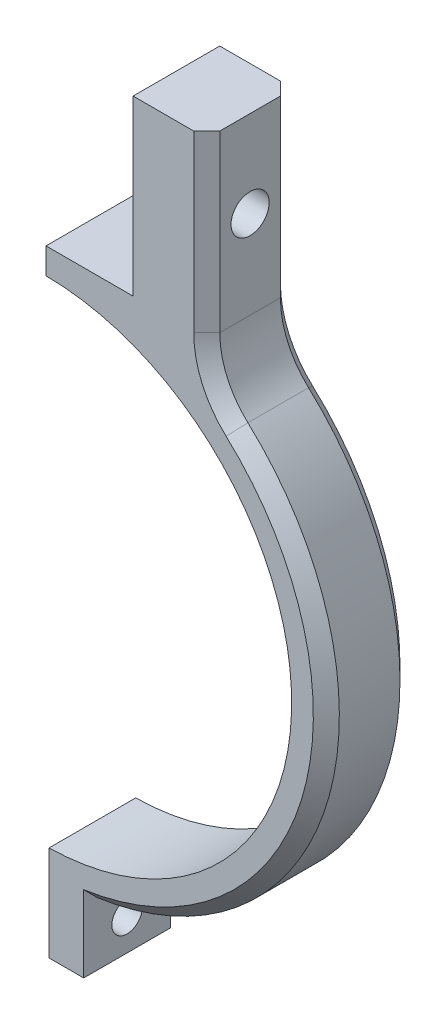
ISO-10303-21;
HEADER;
FILE_DESCRIPTION(('STEP AP214'),'2;1');
FILE_NAME('part.step','',(''),(''),'','','');
FILE_SCHEMA(('AUTOMOTIVE_DESIGN { 1 0 10303 214 1 1 1 1 }'));
ENDSEC;
DATA;
#1=APPLICATION_CONTEXT('core data for automotive mechanical design processes');
#2=APPLICATION_PROTOCOL_DEFINITION('international standard','automotive_design',2000,#1);
#3=PRODUCT_CONTEXT('',#1,'mechanical');
#4=PRODUCT('Part','Part','',(#3));
#5=PRODUCT_RELATED_PRODUCT_CATEGORY('part','',(#4));
#6=PRODUCT_DEFINITION_FORMATION('','',#4);
#7=PRODUCT_DEFINITION_CONTEXT('part definition',#1,'design');
#8=PRODUCT_DEFINITION('design','',#6,#7);
#9=PRODUCT_DEFINITION_SHAPE('','',#8);
#10=(LENGTH_UNIT() NAMED_UNIT(*) SI_UNIT(.MILLI.,.METRE.));
#11=(NAMED_UNIT(*) PLANE_ANGLE_UNIT() SI_UNIT($,.RADIAN.));
#12=(NAMED_UNIT(*) SI_UNIT($,.STERADIAN.) SOLID_ANGLE_UNIT());
#13=UNCERTAINTY_MEASURE_WITH_UNIT(LENGTH_MEASURE(1.E-05),#10,'distance_accuracy_value','');
#14=(GEOMETRIC_REPRESENTATION_CONTEXT(3) GLOBAL_UNCERTAINTY_ASSIGNED_CONTEXT((#13)) GLOBAL_UNIT_ASSIGNED_CONTEXT((#10,
#11,#12)) REPRESENTATION_CONTEXT('',''));
#15=CARTESIAN_POINT('',(0.,0.,0.));
#16=DIRECTION('',(0.,0.,1.));
#17=DIRECTION('',(1.,0.,0.));
#18=AXIS2_PLACEMENT_3D('',#15,#16,#17);
#19=CARTESIAN_POINT('',(-10.2,31.5,10.));
#20=DIRECTION('',(0.,-1.,0.));
#21=DIRECTION('',(0.,0.,-1.));
#22=AXIS2_PLACEMENT_3D('',#19,#20,#21);
#23=PLANE('',#22);
#24=DIRECTION('',(0.,0.,-1.));
#25=VECTOR('',#24,1.);
#26=CARTESIAN_POINT('',(0.150000000000001,31.5,10.));
#27=LINE('',#26,#25);
#28=CARTESIAN_POINT('',(0.15,31.5,10.));
#29=VERTEX_POINT('',#28);
#30=CARTESIAN_POINT('',(0.150000000000001,31.5,0.));
#31=VERTEX_POINT('',#30);
#32=EDGE_CURVE('E55',#29,#31,#27,.T.);
#33=ORIENTED_EDGE('',*,*,#32,.F.);
#34=DIRECTION('',(-1.,0.,0.));
#35=VECTOR('',#34,1.);
#36=CARTESIAN_POINT('',(-10.2,31.5,10.));
#37=LINE('',#36,#35);
#38=CARTESIAN_POINT('',(10.2,31.5,10.));
#39=VERTEX_POINT('',#38);
#40=EDGE_CURVE('E160',#39,#29,#37,.T.);
#41=ORIENTED_EDGE('',*,*,#40,.F.);
#42=DIRECTION('',(0.,0.,-1.));
#43=VECTOR('',#42,1.);
#44=CARTESIAN_POINT('',(10.2,31.5,10.));
#45=LINE('',#44,#43);
#46=CARTESIAN_POINT('',(10.2,31.5,0.));
#47=VERTEX_POINT('',#46);
#48=EDGE_CURVE('E201',#39,#47,#45,.T.);
#49=ORIENTED_EDGE('',*,*,#48,.T.);
#50=DIRECTION('',(-1.,0.,0.));
#51=VECTOR('',#50,1.);
#52=CARTESIAN_POINT('',(-10.2,31.5,0.));
#53=LINE('',#52,#51);
#54=EDGE_CURVE('E184',#47,#31,#53,.T.);
#55=ORIENTED_EDGE('',*,*,#54,.T.);
#56=EDGE_LOOP('',(#33,#41,#49,#55));
#57=FACE_BOUND('',#56,.T.);
#58=ADVANCED_FACE('F36',(#57),#23,.F.);
#59=CARTESIAN_POINT('',(0.,0.,10.));
#60=DIRECTION('',(0.,0.,-1.));
#61=DIRECTION('',(-1.,0.,0.));
#62=AXIS2_PLACEMENT_3D('',#59,#60,#61);
#63=CYLINDRICAL_SURFACE('',#62,28.5);
#64=DIRECTION('',(0.,0.,-1.));
#65=VECTOR('',#64,1.);
#66=CARTESIAN_POINT('',(0.150000000000001,28.4996052604242,10.));
#67=LINE('',#66,#65);
#68=CARTESIAN_POINT('',(0.150000000000001,28.4996052604242,0.));
#69=VERTEX_POINT('',#68);
#70=CARTESIAN_POINT('',(0.150000000000001,28.4996052604242,10.));
#71=VERTEX_POINT('',#70);
#72=EDGE_CURVE('E146',#69,#71,#67,.F.);
#73=ORIENTED_EDGE('',*,*,#72,.F.);
#74=CARTESIAN_POINT('',(0.,0.,0.));
#75=DIRECTION('',(0.,0.,-1.));
#76=DIRECTION('',(1.,0.,0.));
#77=AXIS2_PLACEMENT_3D('',#74,#75,#76);
#78=CIRCLE('',#77,28.5);
#79=CARTESIAN_POINT('',(0.500000000000003,-28.49561369755,0.));
#80=VERTEX_POINT('',#79);
#81=EDGE_CURVE('E187',#69,#80,#78,.T.);
#82=ORIENTED_EDGE('',*,*,#81,.T.);
#83=DIRECTION('',(0.,0.,-1.));
#84=VECTOR('',#83,1.);
#85=CARTESIAN_POINT('',(0.500000000000003,-28.49561369755,10.));
#86=LINE('',#85,#84);
#87=CARTESIAN_POINT('',(0.500000000000003,-28.49561369755,10.));
#88=VERTEX_POINT('',#87);
#89=EDGE_CURVE('E164',#88,#80,#86,.T.);
#90=ORIENTED_EDGE('',*,*,#89,.F.);
#91=CARTESIAN_POINT('',(0.,0.,10.));
#92=DIRECTION('',(0.,0.,-1.));
#93=DIRECTION('',(1.,0.,0.));
#94=AXIS2_PLACEMENT_3D('',#91,#92,#93);
#95=CIRCLE('',#94,28.5);
#96=EDGE_CURVE('E157',#71,#88,#95,.T.);
#97=ORIENTED_EDGE('',*,*,#96,.F.);
#98=EDGE_LOOP('',(#73,#82,#90,#97));
#99=FACE_BOUND('',#98,.T.);
#100=ADVANCED_FACE('F162',(#99),#63,.F.);
#101=CARTESIAN_POINT('',(0.,0.,10.));
#102=DIRECTION('',(0.,0.,1.));
#103=DIRECTION('',(1.,0.,0.));
#104=AXIS2_PLACEMENT_3D('',#101,#102,#103);
#105=PLANE('',#104);
#106=ORIENTED_EDGE('',*,*,#40,.T.);
#107=DIRECTION('',(0.,1.,0.));
#108=VECTOR('',#107,1.);
#109=CARTESIAN_POINT('',(0.15,32.2083741637337,10.));
#110=LINE('',#109,#108);
#111=EDGE_CURVE('E149',#71,#29,#110,.T.);
#112=ORIENTED_EDGE('',*,*,#111,.F.);
#113=ORIENTED_EDGE('',*,*,#96,.T.);
#114=DIRECTION('',(0.,-1.,0.));
#115=VECTOR('',#114,1.);
#116=CARTESIAN_POINT('',(0.500000000000003,-28.49561369755,10.));
#117=LINE('',#116,#115);
#118=CARTESIAN_POINT('',(0.500000000000005,-39.4961536185438,10.));
#119=VERTEX_POINT('',#118);
#120=EDGE_CURVE('E166',#88,#119,#117,.T.);
#121=ORIENTED_EDGE('',*,*,#120,.T.);
#122=DIRECTION('',(1.,0.,0.));
#123=VECTOR('',#122,1.);
#124=CARTESIAN_POINT('',(0.500000000000005,-39.4961536185438,10.));
#125=LINE('',#124,#123);
#126=CARTESIAN_POINT('',(4.5,-39.4961536185438,10.));
#127=VERTEX_POINT('',#126);
#128=EDGE_CURVE('E168',#119,#127,#125,.T.);
#129=ORIENTED_EDGE('',*,*,#128,.T.);
#130=DIRECTION('',(0.,1.,0.));
#131=VECTOR('',#130,1.);
#132=CARTESIAN_POINT('',(4.5,-39.4961536185438,10.));
#133=LINE('',#132,#131);
#134=CARTESIAN_POINT('',(4.50000000000001,-30.67164814613,10.));
#135=VERTEX_POINT('',#134);
#136=EDGE_CURVE('E193',#127,#135,#133,.T.);
#137=ORIENTED_EDGE('',*,*,#136,.T.);
#138=CARTESIAN_POINT('',(0.,0.,10.));
#139=DIRECTION('',(0.,0.,1.));
#140=DIRECTION('',(1.,0.,0.));
#141=AXIS2_PLACEMENT_3D('',#138,#139,#140);
#142=CIRCLE('',#141,31.);
#143=CARTESIAN_POINT('',(20.9341176470588,22.8640048622086,10.));
#144=VERTEX_POINT('',#143);
#145=EDGE_CURVE('E250',#135,#144,#142,.T.);
#146=ORIENTED_EDGE('',*,*,#145,.T.);
#147=CARTESIAN_POINT('',(28.7,31.3458131175441,10.));
#148=DIRECTION('',(0.,0.,1.));
#149=DIRECTION('',(1.,0.,0.));
#150=AXIS2_PLACEMENT_3D('',#147,#148,#149);
#151=CIRCLE('',#150,11.5);
#152=CARTESIAN_POINT('',(17.2,31.3458131175441,10.));
#153=VERTEX_POINT('',#152);
#154=EDGE_CURVE('E63',#144,#153,#151,.F.);
#155=ORIENTED_EDGE('',*,*,#154,.T.);
#156=DIRECTION('',(0.,1.,0.));
#157=VECTOR('',#156,1.);
#158=CARTESIAN_POINT('',(17.2,51.5,10.));
#159=LINE('',#158,#157);
#160=CARTESIAN_POINT('',(17.2,51.5,10.));
#161=VERTEX_POINT('',#160);
#162=EDGE_CURVE('E253',#153,#161,#159,.T.);
#163=ORIENTED_EDGE('',*,*,#162,.T.);
#164=DIRECTION('',(-1.,0.,0.));
#165=VECTOR('',#164,1.);
#166=CARTESIAN_POINT('',(10.2,51.5,10.));
#167=LINE('',#166,#165);
#168=CARTESIAN_POINT('',(10.2,51.5,10.));
#169=VERTEX_POINT('',#168);
#170=EDGE_CURVE('E371',#161,#169,#167,.T.);
#171=ORIENTED_EDGE('',*,*,#170,.T.);
#172=DIRECTION('',(0.,-1.,0.));
#173=VECTOR('',#172,1.);
#174=CARTESIAN_POINT('',(10.2,31.5,10.));
#175=LINE('',#174,#173);
#176=EDGE_CURVE('E170',#169,#39,#175,.T.);
#177=ORIENTED_EDGE('',*,*,#176,.T.);
#178=EDGE_LOOP('',(#106,#112,#113,#121,#129,#137,#146,#155,#163,#171,#177));
#179=FACE_BOUND('',#178,.T.);
#180=ADVANCED_FACE('F156',(#179),#105,.T.);
#181=CARTESIAN_POINT('',(0.,0.,0.));
#182=DIRECTION('',(0.,0.,1.));
#183=DIRECTION('',(1.,0.,0.));
#184=AXIS2_PLACEMENT_3D('',#181,#182,#183);
#185=PLANE('',#184);
#186=DIRECTION('',(0.,1.,0.));
#187=VECTOR('',#186,1.);
#188=CARTESIAN_POINT('',(0.15,32.2083741637337,0.));
#189=LINE('',#188,#187);
#190=EDGE_CURVE('E150',#69,#31,#189,.T.);
#191=ORIENTED_EDGE('',*,*,#190,.T.);
#192=ORIENTED_EDGE('',*,*,#54,.F.);
#193=DIRECTION('',(0.,-1.,0.));
#194=VECTOR('',#193,1.);
#195=CARTESIAN_POINT('',(10.2,31.5,0.));
#196=LINE('',#195,#194);
#197=CARTESIAN_POINT('',(10.2,51.5,0.));
#198=VERTEX_POINT('',#197);
#199=EDGE_CURVE('E181',#198,#47,#196,.T.);
#200=ORIENTED_EDGE('',*,*,#199,.F.);
#201=DIRECTION('',(-1.,0.,0.));
#202=VECTOR('',#201,1.);
#203=CARTESIAN_POINT('',(10.2,51.5,0.));
#204=LINE('',#203,#202);
#205=CARTESIAN_POINT('',(17.2,51.5,0.));
#206=VERTEX_POINT('',#205);
#207=EDGE_CURVE('E178',#206,#198,#204,.T.);
#208=ORIENTED_EDGE('',*,*,#207,.F.);
#209=DIRECTION('',(0.,-1.,0.));
#210=VECTOR('',#209,1.);
#211=CARTESIAN_POINT('',(17.2,0.,0.));
#212=LINE('',#211,#210);
#213=CARTESIAN_POINT('',(17.2,31.3458131175441,0.));
#214=VERTEX_POINT('',#213);
#215=EDGE_CURVE('E229',#206,#214,#212,.T.);
#216=ORIENTED_EDGE('',*,*,#215,.T.);
#217=CARTESIAN_POINT('',(28.7,31.3458131175441,0.));
#218=DIRECTION('',(0.,0.,1.));
#219=DIRECTION('',(1.,0.,0.));
#220=AXIS2_PLACEMENT_3D('',#217,#218,#219);
#221=CIRCLE('',#220,11.5);
#222=CARTESIAN_POINT('',(20.9341176470588,22.8640048622086,0.));
#223=VERTEX_POINT('',#222);
#224=EDGE_CURVE('E227',#214,#223,#221,.T.);
#225=ORIENTED_EDGE('',*,*,#224,.T.);
#226=CARTESIAN_POINT('',(0.,0.,0.));
#227=DIRECTION('',(0.,0.,1.));
#228=DIRECTION('',(1.,0.,0.));
#229=AXIS2_PLACEMENT_3D('',#226,#227,#228);
#230=CIRCLE('',#229,31.);
#231=CARTESIAN_POINT('',(4.50000000000001,-30.67164814613,0.));
#232=VERTEX_POINT('',#231);
#233=EDGE_CURVE('E224',#223,#232,#230,.F.);
#234=ORIENTED_EDGE('',*,*,#233,.T.);
#235=DIRECTION('',(0.,1.,0.));
#236=VECTOR('',#235,1.);
#237=CARTESIAN_POINT('',(4.5,-39.4961536185438,0.));
#238=LINE('',#237,#236);
#239=CARTESIAN_POINT('',(4.5,-39.4961536185438,0.));
#240=VERTEX_POINT('',#239);
#241=EDGE_CURVE('E176',#240,#232,#238,.T.);
#242=ORIENTED_EDGE('',*,*,#241,.F.);
#243=DIRECTION('',(1.,0.,0.));
#244=VECTOR('',#243,1.);
#245=CARTESIAN_POINT('',(0.500000000000005,-39.4961536185438,0.));
#246=LINE('',#245,#244);
#247=CARTESIAN_POINT('',(0.500000000000005,-39.4961536185438,0.));
#248=VERTEX_POINT('',#247);
#249=EDGE_CURVE('E191',#248,#240,#246,.T.);
#250=ORIENTED_EDGE('',*,*,#249,.F.);
#251=DIRECTION('',(0.,-1.,0.));
#252=VECTOR('',#251,1.);
#253=CARTESIAN_POINT('',(0.500000000000004,-32.4961536185438,0.));
#254=LINE('',#253,#252);
#255=EDGE_CURVE('E189',#80,#248,#254,.T.);
#256=ORIENTED_EDGE('',*,*,#255,.F.);
#257=ORIENTED_EDGE('',*,*,#81,.F.);
#258=EDGE_LOOP('',(#191,#192,#200,#208,#216,#225,#234,#242,#250,#256,#257));
#259=FACE_BOUND('',#258,.T.);
#260=ADVANCED_FACE('F328',(#259),#185,.F.);
#261=CARTESIAN_POINT('',(4.5,-39.4961536185438,10.));
#262=DIRECTION('',(-1.,0.,0.));
#263=DIRECTION('',(0.,-1.,0.));
#264=AXIS2_PLACEMENT_3D('',#261,#262,#263);
#265=PLANE('',#264);
#266=CARTESIAN_POINT('',(4.5,-35.841553748703,5.));
#267=DIRECTION('',(-1.,0.,0.));
#268=DIRECTION('',(0.,-1.,0.));
#269=AXIS2_PLACEMENT_3D('',#266,#267,#268);
#270=CIRCLE('',#269,1.75);
#271=CARTESIAN_POINT('',(4.5,-37.591553748703,5.));
#272=VERTEX_POINT('',#271);
#273=EDGE_CURVE('E179',#272,#272,#270,.T.);
#274=ORIENTED_EDGE('',*,*,#273,.T.);
#275=EDGE_LOOP('',(#274));
#276=FACE_BOUND('',#275,.T.);
#277=ORIENTED_EDGE('',*,*,#241,.T.);
#278=CARTESIAN_POINT('',(4.50000000000001,-30.67164814613,0.));
#279=CARTESIAN_POINT('',(4.50000000000001,-30.9242596647789,0.249938819005462));
#280=CARTESIAN_POINT('',(4.50000000000001,-31.1768409018748,0.499908228551524));
#281=CARTESIAN_POINT('',(4.50000000000001,-31.6819428127855,0.999908228551563));
#282=CARTESIAN_POINT('',(4.50000000000001,-31.9344634866003,1.2499388190055));
#283=CARTESIAN_POINT('',(4.50000000000001,-32.1869538788622,1.49999999999999));
#284=B_SPLINE_CURVE_WITH_KNOTS('',3,(#278,#279,#280,#281,#282,#283),.UNSPECIFIED.,.F.,.F.,(4,2,
4),(0.,1.06608530773822,2.13217061473749),.UNSPECIFIED.);
#285=CARTESIAN_POINT('',(4.49999999999999,-32.1869538788622,1.49999999999999));
#286=VERTEX_POINT('',#285);
#287=EDGE_CURVE('E47',#232,#286,#284,.T.);
#288=ORIENTED_EDGE('',*,*,#287,.T.);
#289=DIRECTION('',(0.,0.,-1.));
#290=VECTOR('',#289,1.);
#291=CARTESIAN_POINT('',(4.49999999999999,-32.1869538788622,10.));
#292=LINE('',#291,#290);
#293=CARTESIAN_POINT('',(4.49999999999999,-32.1869538788622,8.50000000000001));
#294=VERTEX_POINT('',#293);
#295=EDGE_CURVE('E210',#294,#286,#292,.T.);
#296=ORIENTED_EDGE('',*,*,#295,.F.);
#297=CARTESIAN_POINT('',(4.49999999999999,-32.1869538788622,8.50000000000001));
#298=CARTESIAN_POINT('',(4.5,-31.9344634866003,8.7500611809945));
#299=CARTESIAN_POINT('',(4.5,-31.6819428127855,9.00009177144843));
#300=CARTESIAN_POINT('',(4.50000000000001,-31.1768409018748,9.50009177144847));
#301=CARTESIAN_POINT('',(4.50000000000001,-30.9242596647789,9.75006118099454));
#302=CARTESIAN_POINT('',(4.50000000000001,-30.67164814613,10.));
#303=B_SPLINE_CURVE_WITH_KNOTS('',3,(#297,#298,#299,#300,#301,#302),.UNSPECIFIED.,.F.,.F.,(4,2,
4),(0.,1.06608530699927,2.1321706147375),.UNSPECIFIED.);
#304=EDGE_CURVE('E11',#294,#135,#303,.T.);
#305=ORIENTED_EDGE('',*,*,#304,.T.);
#306=ORIENTED_EDGE('',*,*,#136,.F.);
#307=DIRECTION('',(0.,0.,-1.));
#308=VECTOR('',#307,1.);
#309=CARTESIAN_POINT('',(4.5,-39.4961536185438,10.));
#310=LINE('',#309,#308);
#311=EDGE_CURVE('E175',#127,#240,#310,.T.);
#312=ORIENTED_EDGE('',*,*,#311,.T.);
#313=EDGE_LOOP('',(#277,#288,#296,#305,#306,#312));
#314=FACE_BOUND('',#313,.T.);
#315=ADVANCED_FACE('F266',(#276,#314),#265,.F.);
#316=CARTESIAN_POINT('',(0.,0.,10.));
#317=DIRECTION('',(0.,0.,-1.));
#318=DIRECTION('',(-1.,0.,0.));
#319=AXIS2_PLACEMENT_3D('',#316,#317,#318);
#320=CYLINDRICAL_SURFACE('',#319,32.5);
#321=ORIENTED_EDGE('',*,*,#295,.T.);
#322=CARTESIAN_POINT('',(0.,0.,1.49999999999999));
#323=DIRECTION('',(0.,0.,1.));
#324=DIRECTION('',(1.,0.,0.));
#325=AXIS2_PLACEMENT_3D('',#322,#323,#324);
#326=CIRCLE('',#325,32.5);
#327=CARTESIAN_POINT('',(21.9470588235294,23.970327678122,1.49999999999999));
#328=VERTEX_POINT('',#327);
#329=EDGE_CURVE('E248',#286,#328,#326,.T.);
#330=ORIENTED_EDGE('',*,*,#329,.T.);
#331=DIRECTION('',(0.,0.,-1.));
#332=VECTOR('',#331,1.);
#333=CARTESIAN_POINT('',(21.9470588235294,23.970327678122,10.));
#334=LINE('',#333,#332);
#335=CARTESIAN_POINT('',(21.9470588235294,23.970327678122,8.50000000000001));
#336=VERTEX_POINT('',#335);
#337=EDGE_CURVE('E221',#328,#336,#334,.F.);
#338=ORIENTED_EDGE('',*,*,#337,.T.);
#339=CARTESIAN_POINT('',(0.,0.,8.50000000000001));
#340=DIRECTION('',(0.,0.,1.));
#341=DIRECTION('',(1.,0.,0.));
#342=AXIS2_PLACEMENT_3D('',#339,#340,#341);
#343=CIRCLE('',#342,32.5);
#344=EDGE_CURVE('E246',#336,#294,#343,.F.);
#345=ORIENTED_EDGE('',*,*,#344,.T.);
#346=EDGE_LOOP('',(#321,#330,#338,#345));
#347=FACE_BOUND('',#346,.T.);
#348=ADVANCED_FACE('F321',(#347),#320,.T.);
#349=CARTESIAN_POINT('',(18.7,51.5,10.));
#350=DIRECTION('',(-1.,0.,0.));
#351=DIRECTION('',(0.,0.,1.));
#352=AXIS2_PLACEMENT_3D('',#349,#350,#351);
#353=PLANE('',#352);
#354=CARTESIAN_POINT('',(18.7,41.5,5.));
#355=DIRECTION('',(-1.,0.,0.));
#356=DIRECTION('',(0.,0.,1.));
#357=AXIS2_PLACEMENT_3D('',#354,#355,#356);
#358=CIRCLE('',#357,2.2);
#359=CARTESIAN_POINT('',(18.7,41.5,7.2));
#360=VERTEX_POINT('',#359);
#361=EDGE_CURVE('E218',#360,#360,#358,.T.);
#362=ORIENTED_EDGE('',*,*,#361,.T.);
#363=EDGE_LOOP('',(#362));
#364=FACE_BOUND('',#363,.T.);
#365=DIRECTION('',(0.,0.,1.));
#366=VECTOR('',#365,1.);
#367=CARTESIAN_POINT('',(18.7,31.3458131175441,0.));
#368=LINE('',#367,#366);
#369=CARTESIAN_POINT('',(18.7,31.3458131175441,8.50000000000001));
#370=VERTEX_POINT('',#369);
#371=CARTESIAN_POINT('',(18.7,31.3458131175441,1.49999999999999));
#372=VERTEX_POINT('',#371);
#373=EDGE_CURVE('E214',#370,#372,#368,.F.);
#374=ORIENTED_EDGE('',*,*,#373,.T.);
#375=DIRECTION('',(0.,1.,0.));
#376=VECTOR('',#375,1.);
#377=CARTESIAN_POINT('',(18.7,51.5,1.49999999999999));
#378=LINE('',#377,#376);
#379=CARTESIAN_POINT('',(18.7,51.5,1.49999999999999));
#380=VERTEX_POINT('',#379);
#381=EDGE_CURVE('E234',#372,#380,#378,.T.);
#382=ORIENTED_EDGE('',*,*,#381,.T.);
#383=DIRECTION('',(0.,0.,-1.));
#384=VECTOR('',#383,1.);
#385=CARTESIAN_POINT('',(18.7,51.5,10.));
#386=LINE('',#385,#384);
#387=CARTESIAN_POINT('',(18.7,51.5,8.50000000000001));
#388=VERTEX_POINT('',#387);
#389=EDGE_CURVE('E207',#388,#380,#386,.T.);
#390=ORIENTED_EDGE('',*,*,#389,.F.);
#391=DIRECTION('',(0.,-1.,0.));
#392=VECTOR('',#391,1.);
#393=CARTESIAN_POINT('',(18.7,31.3458131175441,8.50000000000001));
#394=LINE('',#393,#392);
#395=EDGE_CURVE('E232',#388,#370,#394,.T.);
#396=ORIENTED_EDGE('',*,*,#395,.T.);
#397=EDGE_LOOP('',(#374,#382,#390,#396));
#398=FACE_BOUND('',#397,.T.);
#399=ADVANCED_FACE('F318',(#364,#398),#353,.F.);
#400=CARTESIAN_POINT('',(10.2,51.5,10.));
#401=DIRECTION('',(0.,-1.,0.));
#402=DIRECTION('',(0.,0.,-1.));
#403=AXIS2_PLACEMENT_3D('',#400,#401,#402);
#404=PLANE('',#403);
#405=ORIENTED_EDGE('',*,*,#389,.T.);
#406=DIRECTION('',(0.70710678118655,0.,0.707106781186545));
#407=VECTOR('',#406,1.);
#408=CARTESIAN_POINT('',(18.7,51.5,1.49999999999999));
#409=LINE('',#408,#407);
#410=EDGE_CURVE('E240',#380,#206,#409,.F.);
#411=ORIENTED_EDGE('',*,*,#410,.T.);
#412=ORIENTED_EDGE('',*,*,#207,.T.);
#413=DIRECTION('',(0.,0.,-1.));
#414=VECTOR('',#413,1.);
#415=CARTESIAN_POINT('',(10.2,51.5,10.));
#416=LINE('',#415,#414);
#417=EDGE_CURVE('E204',#169,#198,#416,.T.);
#418=ORIENTED_EDGE('',*,*,#417,.F.);
#419=ORIENTED_EDGE('',*,*,#170,.F.);
#420=DIRECTION('',(0.707106781186548,0.,-0.707106781186548));
#421=VECTOR('',#420,1.);
#422=CARTESIAN_POINT('',(17.2,51.5,10.));
#423=LINE('',#422,#421);
#424=EDGE_CURVE('E238',#161,#388,#423,.T.);
#425=ORIENTED_EDGE('',*,*,#424,.T.);
#426=EDGE_LOOP('',(#405,#411,#412,#418,#419,#425));
#427=FACE_BOUND('',#426,.T.);
#428=ADVANCED_FACE('F314',(#427),#404,.F.);
#429=CARTESIAN_POINT('',(10.2,31.5,10.));
#430=DIRECTION('',(1.,0.,0.));
#431=DIRECTION('',(0.,0.,-1.));
#432=AXIS2_PLACEMENT_3D('',#429,#430,#431);
#433=PLANE('',#432);
#434=CARTESIAN_POINT('',(10.2,41.5,5.));
#435=DIRECTION('',(1.,0.,0.));
#436=DIRECTION('',(0.,0.,-1.));
#437=AXIS2_PLACEMENT_3D('',#434,#435,#436);
#438=CIRCLE('',#437,2.2);
#439=CARTESIAN_POINT('',(10.2,41.5,2.8));
#440=VERTEX_POINT('',#439);
#441=EDGE_CURVE('E344',#440,#440,#438,.T.);
#442=ORIENTED_EDGE('',*,*,#441,.T.);
#443=EDGE_LOOP('',(#442));
#444=FACE_BOUND('',#443,.T.);
#445=ORIENTED_EDGE('',*,*,#199,.T.);
#446=ORIENTED_EDGE('',*,*,#48,.F.);
#447=ORIENTED_EDGE('',*,*,#176,.F.);
#448=ORIENTED_EDGE('',*,*,#417,.T.);
#449=EDGE_LOOP('',(#445,#446,#447,#448));
#450=FACE_BOUND('',#449,.T.);
#451=ADVANCED_FACE('F310',(#444,#450),#433,.F.);
#452=CARTESIAN_POINT('',(0.500000000000004,-32.4961536185438,10.));
#453=DIRECTION('',(1.,0.,0.));
#454=DIRECTION('',(0.,1.,0.));
#455=AXIS2_PLACEMENT_3D('',#452,#453,#454);
#456=PLANE('',#455);
#457=CARTESIAN_POINT('',(0.5,-35.841553748703,5.));
#458=DIRECTION('',(1.,0.,0.));
#459=DIRECTION('',(0.,1.,0.));
#460=AXIS2_PLACEMENT_3D('',#457,#458,#459);
#461=CIRCLE('',#460,1.75);
#462=CARTESIAN_POINT('',(0.5,-34.091553748703,5.));
#463=VERTEX_POINT('',#462);
#464=EDGE_CURVE('E215',#463,#463,#461,.T.);
#465=ORIENTED_EDGE('',*,*,#464,.T.);
#466=EDGE_LOOP('',(#465));
#467=FACE_BOUND('',#466,.T.);
#468=ORIENTED_EDGE('',*,*,#255,.T.);
#469=DIRECTION('',(0.,0.,-1.));
#470=VECTOR('',#469,1.);
#471=CARTESIAN_POINT('',(0.500000000000005,-39.4961536185438,10.));
#472=LINE('',#471,#470);
#473=EDGE_CURVE('E196',#119,#248,#472,.T.);
#474=ORIENTED_EDGE('',*,*,#473,.F.);
#475=ORIENTED_EDGE('',*,*,#120,.F.);
#476=ORIENTED_EDGE('',*,*,#89,.T.);
#477=EDGE_LOOP('',(#468,#474,#475,#476));
#478=FACE_BOUND('',#477,.T.);
#479=ADVANCED_FACE('F313',(#467,#478),#456,.F.);
#480=CARTESIAN_POINT('',(0.500000000000005,-39.4961536185438,10.));
#481=DIRECTION('',(0.,1.,0.));
#482=DIRECTION('',(0.,0.,1.));
#483=AXIS2_PLACEMENT_3D('',#480,#481,#482);
#484=PLANE('',#483);
#485=ORIENTED_EDGE('',*,*,#249,.T.);
#486=ORIENTED_EDGE('',*,*,#311,.F.);
#487=ORIENTED_EDGE('',*,*,#128,.F.);
#488=ORIENTED_EDGE('',*,*,#473,.T.);
#489=EDGE_LOOP('',(#485,#486,#487,#488));
#490=FACE_BOUND('',#489,.T.);
#491=ADVANCED_FACE('F391',(#490),#484,.F.);
#492=CARTESIAN_POINT('',(32.5,-35.841553748703,5.));
#493=DIRECTION('',(-1.,0.,0.));
#494=DIRECTION('',(0.,0.,1.));
#495=AXIS2_PLACEMENT_3D('',#492,#493,#494);
#496=CYLINDRICAL_SURFACE('',#495,1.75);
#497=ORIENTED_EDGE('',*,*,#464,.F.);
#498=EDGE_LOOP('',(#497));
#499=FACE_BOUND('',#498,.T.);
#500=ORIENTED_EDGE('',*,*,#273,.F.);
#501=EDGE_LOOP('',(#500));
#502=FACE_BOUND('',#501,.T.);
#503=ADVANCED_FACE('F395',(#499,#502),#496,.F.);
#504=CARTESIAN_POINT('',(32.5,41.5,5.));
#505=DIRECTION('',(-1.,0.,0.));
#506=DIRECTION('',(0.,-1.,0.));
#507=AXIS2_PLACEMENT_3D('',#504,#505,#506);
#508=CYLINDRICAL_SURFACE('',#507,2.2);
#509=ORIENTED_EDGE('',*,*,#441,.F.);
#510=EDGE_LOOP('',(#509));
#511=FACE_BOUND('',#510,.T.);
#512=ORIENTED_EDGE('',*,*,#361,.F.);
#513=EDGE_LOOP('',(#512));
#514=FACE_BOUND('',#513,.T.);
#515=ADVANCED_FACE('F401',(#511,#514),#508,.F.);
#516=CARTESIAN_POINT('',(28.7,31.3458131175441,10.));
#517=DIRECTION('',(0.,0.,-1.));
#518=DIRECTION('',(-1.,0.,0.));
#519=AXIS2_PLACEMENT_3D('',#516,#517,#518);
#520=CYLINDRICAL_SURFACE('',#519,10.);
#521=ORIENTED_EDGE('',*,*,#337,.F.);
#522=CARTESIAN_POINT('',(28.7,31.3458131175441,1.49999999999999));
#523=DIRECTION('',(0.,0.,1.));
#524=DIRECTION('',(1.,0.,0.));
#525=AXIS2_PLACEMENT_3D('',#522,#523,#524);
#526=CIRCLE('',#525,10.);
#527=EDGE_CURVE('E244',#328,#372,#526,.F.);
#528=ORIENTED_EDGE('',*,*,#527,.T.);
#529=ORIENTED_EDGE('',*,*,#373,.F.);
#530=CARTESIAN_POINT('',(28.7,31.3458131175441,8.50000000000001));
#531=DIRECTION('',(0.,0.,1.));
#532=DIRECTION('',(1.,0.,0.));
#533=AXIS2_PLACEMENT_3D('',#530,#531,#532);
#534=CIRCLE('',#533,10.);
#535=EDGE_CURVE('E242',#370,#336,#534,.T.);
#536=ORIENTED_EDGE('',*,*,#535,.T.);
#537=EDGE_LOOP('',(#521,#528,#529,#536));
#538=FACE_BOUND('',#537,.T.);
#539=ADVANCED_FACE('F280',(#538),#520,.F.);
#540=CARTESIAN_POINT('',(0.,0.,1.49999999999999));
#541=DIRECTION('',(0.,0.,1.));
#542=DIRECTION('',(1.,0.,0.));
#543=AXIS2_PLACEMENT_3D('',#540,#541,#542);
#544=CONICAL_SURFACE('',#543,32.5,0.785398163397452);
#545=ORIENTED_EDGE('',*,*,#287,.F.);
#546=ORIENTED_EDGE('',*,*,#233,.F.);
#547=DIRECTION('',(-0.477505049883622,-0.521525576875806,-0.707106781186546));
#548=VECTOR('',#547,1.);
#549=CARTESIAN_POINT('',(21.9470588235294,23.970327678122,1.49999999999999));
#550=LINE('',#549,#548);
#551=EDGE_CURVE('E340',#328,#223,#550,.T.);
#552=ORIENTED_EDGE('',*,*,#551,.F.);
#553=ORIENTED_EDGE('',*,*,#329,.F.);
#554=EDGE_LOOP('',(#545,#546,#552,#553));
#555=FACE_BOUND('',#554,.T.);
#556=ADVANCED_FACE('F271',(#555),#544,.T.);
#557=CARTESIAN_POINT('',(28.7,31.3458131175441,0.));
#558=DIRECTION('',(0.,0.,-1.));
#559=DIRECTION('',(-1.,0.,0.));
#560=AXIS2_PLACEMENT_3D('',#557,#558,#559);
#561=CONICAL_SURFACE('',#560,11.5,0.785398163397451);
#562=ORIENTED_EDGE('',*,*,#551,.T.);
#563=ORIENTED_EDGE('',*,*,#224,.F.);
#564=DIRECTION('',(-0.707106781186549,0.,-0.707106781186546));
#565=VECTOR('',#564,1.);
#566=CARTESIAN_POINT('',(18.7,31.3458131175441,1.49999999999999));
#567=LINE('',#566,#565);
#568=EDGE_CURVE('E345',#372,#214,#567,.T.);
#569=ORIENTED_EDGE('',*,*,#568,.F.);
#570=ORIENTED_EDGE('',*,*,#527,.F.);
#571=EDGE_LOOP('',(#562,#563,#569,#570));
#572=FACE_BOUND('',#571,.T.);
#573=ADVANCED_FACE('F279',(#572),#561,.F.);
#574=CARTESIAN_POINT('',(18.7,51.5,1.49999999999999));
#575=DIRECTION('',(-0.707106781186545,0.,0.70710678118655));
#576=DIRECTION('',(0.,1.,0.));
#577=AXIS2_PLACEMENT_3D('',#574,#575,#576);
#578=PLANE('',#577);
#579=ORIENTED_EDGE('',*,*,#568,.T.);
#580=ORIENTED_EDGE('',*,*,#215,.F.);
#581=ORIENTED_EDGE('',*,*,#410,.F.);
#582=ORIENTED_EDGE('',*,*,#381,.F.);
#583=EDGE_LOOP('',(#579,#580,#581,#582));
#584=FACE_BOUND('',#583,.T.);
#585=ADVANCED_FACE('F298',(#584),#578,.F.);
#586=CARTESIAN_POINT('',(0.,0.,10.));
#587=DIRECTION('',(0.,0.,-1.));
#588=DIRECTION('',(-1.,0.,0.));
#589=AXIS2_PLACEMENT_3D('',#586,#587,#588);
#590=CONICAL_SURFACE('',#589,31.,0.785398163397448);
#591=ORIENTED_EDGE('',*,*,#304,.F.);
#592=ORIENTED_EDGE('',*,*,#344,.F.);
#593=DIRECTION('',(0.477505049883622,0.521525576875803,-0.707106781186548));
#594=VECTOR('',#593,1.);
#595=CARTESIAN_POINT('',(20.9341176470588,22.8640048622086,10.));
#596=LINE('',#595,#594);
#597=EDGE_CURVE('E42',#144,#336,#596,.T.);
#598=ORIENTED_EDGE('',*,*,#597,.F.);
#599=ORIENTED_EDGE('',*,*,#145,.F.);
#600=EDGE_LOOP('',(#591,#592,#598,#599));
#601=FACE_BOUND('',#600,.T.);
#602=ADVANCED_FACE('F39',(#601),#590,.T.);
#603=CARTESIAN_POINT('',(28.7,31.3458131175441,10.));
#604=DIRECTION('',(0.,0.,1.));
#605=DIRECTION('',(1.,0.,0.));
#606=AXIS2_PLACEMENT_3D('',#603,#604,#605);
#607=CONICAL_SURFACE('',#606,11.5,0.785398163397448);
#608=ORIENTED_EDGE('',*,*,#597,.T.);
#609=ORIENTED_EDGE('',*,*,#535,.F.);
#610=DIRECTION('',(0.707106781186547,0.,-0.707106781186548));
#611=VECTOR('',#610,1.);
#612=CARTESIAN_POINT('',(17.2,31.3458131175441,10.));
#613=LINE('',#612,#611);
#614=EDGE_CURVE('E358',#153,#370,#613,.T.);
#615=ORIENTED_EDGE('',*,*,#614,.F.);
#616=ORIENTED_EDGE('',*,*,#154,.F.);
#617=EDGE_LOOP('',(#608,#609,#615,#616));
#618=FACE_BOUND('',#617,.T.);
#619=ADVANCED_FACE('F289',(#618),#607,.F.);
#620=CARTESIAN_POINT('',(17.2,0.,10.));
#621=DIRECTION('',(0.707106781186548,0.,0.707106781186548));
#622=DIRECTION('',(0.,-1.,0.));
#623=AXIS2_PLACEMENT_3D('',#620,#621,#622);
#624=PLANE('',#623);
#625=ORIENTED_EDGE('',*,*,#614,.T.);
#626=ORIENTED_EDGE('',*,*,#395,.F.);
#627=ORIENTED_EDGE('',*,*,#424,.F.);
#628=ORIENTED_EDGE('',*,*,#162,.F.);
#629=EDGE_LOOP('',(#625,#626,#627,#628));
#630=FACE_BOUND('',#629,.T.);
#631=ADVANCED_FACE('F284',(#630),#624,.T.);
#632=CARTESIAN_POINT('',(0.15,32.2083741637337,10.));
#633=DIRECTION('',(-1.,0.,0.));
#634=DIRECTION('',(0.,-1.,0.));
#635=AXIS2_PLACEMENT_3D('',#632,#633,#634);
#636=PLANE('',#635);
#637=ORIENTED_EDGE('',*,*,#32,.T.);
#638=ORIENTED_EDGE('',*,*,#190,.F.);
#639=ORIENTED_EDGE('',*,*,#72,.T.);
#640=ORIENTED_EDGE('',*,*,#111,.T.);
#641=EDGE_LOOP('',(#637,#638,#639,#640));
#642=FACE_BOUND('',#641,.T.);
#643=ADVANCED_FACE('F148',(#642),#636,.T.);
#644=CLOSED_SHELL('',(#58,#100,#180,#260,#315,#348,#399,#428,#451,#479,#491,#503,#515,#539,#556,
#573,#585,#602,#619,#631,#643));
#645=MANIFOLD_SOLID_BREP('B2',#644);
#646=ADVANCED_BREP_SHAPE_REPRESENTATION('',(#18,#645),#14);
#647=SHAPE_DEFINITION_REPRESENTATION(#9,#646);
ENDSEC;
END-ISO-10303-21;
